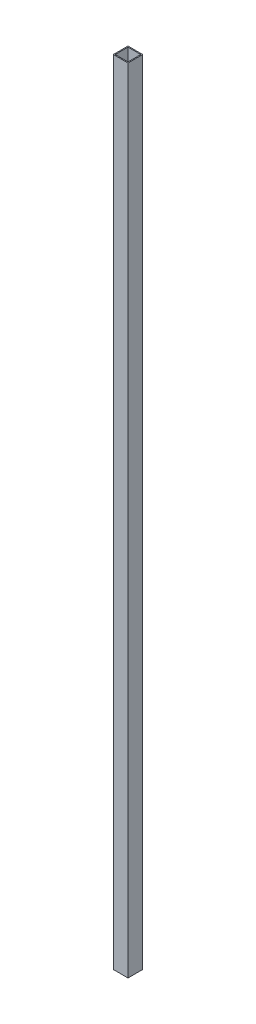
ISO-10303-21;
HEADER;
FILE_DESCRIPTION(('STEP AP214'),'2;1');
FILE_NAME('part.step','',(''),(''),'','','');
FILE_SCHEMA(('AUTOMOTIVE_DESIGN { 1 0 10303 214 1 1 1 1 }'));
ENDSEC;
DATA;
#1=APPLICATION_CONTEXT('core data for automotive mechanical design processes');
#2=APPLICATION_PROTOCOL_DEFINITION('international standard','automotive_design',2000,#1);
#3=PRODUCT_CONTEXT('',#1,'mechanical');
#4=PRODUCT('Part','Part','',(#3));
#5=PRODUCT_RELATED_PRODUCT_CATEGORY('part','',(#4));
#6=PRODUCT_DEFINITION_FORMATION('','',#4);
#7=PRODUCT_DEFINITION_CONTEXT('part definition',#1,'design');
#8=PRODUCT_DEFINITION('design','',#6,#7);
#9=PRODUCT_DEFINITION_SHAPE('','',#8);
#10=(LENGTH_UNIT() NAMED_UNIT(*) SI_UNIT(.MILLI.,.METRE.));
#11=(NAMED_UNIT(*) PLANE_ANGLE_UNIT() SI_UNIT($,.RADIAN.));
#12=(NAMED_UNIT(*) SI_UNIT($,.STERADIAN.) SOLID_ANGLE_UNIT());
#13=UNCERTAINTY_MEASURE_WITH_UNIT(LENGTH_MEASURE(1.E-05),#10,'distance_accuracy_value','');
#14=(GEOMETRIC_REPRESENTATION_CONTEXT(3) GLOBAL_UNCERTAINTY_ASSIGNED_CONTEXT((#13)) GLOBAL_UNIT_ASSIGNED_CONTEXT((#10,
#11,#12)) REPRESENTATION_CONTEXT('',''));
#15=CARTESIAN_POINT('',(0.,0.,0.));
#16=DIRECTION('',(0.,0.,1.));
#17=DIRECTION('',(1.,0.,0.));
#18=AXIS2_PLACEMENT_3D('',#15,#16,#17);
#19=CARTESIAN_POINT('',(0.,807.5,0.));
#20=DIRECTION('',(0.,1.,0.));
#21=DIRECTION('',(0.,0.,1.));
#22=AXIS2_PLACEMENT_3D('',#19,#20,#21);
#23=PLANE('',#22);
#24=DIRECTION('',(0.,0.,-1.));
#25=VECTOR('',#24,1.);
#26=CARTESIAN_POINT('',(15.,807.5,-15.));
#27=LINE('',#26,#25);
#28=CARTESIAN_POINT('',(15.,807.5,15.));
#29=VERTEX_POINT('',#28);
#30=CARTESIAN_POINT('',(15.,807.5,-15.));
#31=VERTEX_POINT('',#30);
#32=EDGE_CURVE('E137',#29,#31,#27,.T.);
#33=ORIENTED_EDGE('',*,*,#32,.T.);
#34=DIRECTION('',(-1.,0.,0.));
#35=VECTOR('',#34,1.);
#36=CARTESIAN_POINT('',(-15.,807.5,-15.));
#37=LINE('',#36,#35);
#38=CARTESIAN_POINT('',(-15.,807.5,-15.));
#39=VERTEX_POINT('',#38);
#40=EDGE_CURVE('E140',#31,#39,#37,.T.);
#41=ORIENTED_EDGE('',*,*,#40,.T.);
#42=DIRECTION('',(0.,0.,1.));
#43=VECTOR('',#42,1.);
#44=CARTESIAN_POINT('',(-15.,807.5,-15.));
#45=LINE('',#44,#43);
#46=CARTESIAN_POINT('',(-15.,807.5,15.));
#47=VERTEX_POINT('',#46);
#48=EDGE_CURVE('E143',#39,#47,#45,.T.);
#49=ORIENTED_EDGE('',*,*,#48,.T.);
#50=DIRECTION('',(1.,0.,0.));
#51=VECTOR('',#50,1.);
#52=CARTESIAN_POINT('',(-15.,807.5,15.));
#53=LINE('',#52,#51);
#54=EDGE_CURVE('E145',#47,#29,#53,.T.);
#55=ORIENTED_EDGE('',*,*,#54,.T.);
#56=EDGE_LOOP('',(#33,#41,#49,#55));
#57=FACE_BOUND('',#56,.T.);
#58=DIRECTION('',(0.,0.,1.));
#59=VECTOR('',#58,1.);
#60=CARTESIAN_POINT('',(-13.,807.5,-13.));
#61=LINE('',#60,#59);
#62=CARTESIAN_POINT('',(-13.,807.5,-13.));
#63=VERTEX_POINT('',#62);
#64=CARTESIAN_POINT('',(-13.,807.5,13.));
#65=VERTEX_POINT('',#64);
#66=EDGE_CURVE('E109',#63,#65,#61,.T.);
#67=ORIENTED_EDGE('',*,*,#66,.F.);
#68=DIRECTION('',(-1.,0.,0.));
#69=VECTOR('',#68,1.);
#70=CARTESIAN_POINT('',(-13.,807.5,-13.));
#71=LINE('',#70,#69);
#72=CARTESIAN_POINT('',(13.,807.5,-13.));
#73=VERTEX_POINT('',#72);
#74=EDGE_CURVE('E101',#73,#63,#71,.T.);
#75=ORIENTED_EDGE('',*,*,#74,.F.);
#76=DIRECTION('',(0.,0.,-1.));
#77=VECTOR('',#76,1.);
#78=CARTESIAN_POINT('',(13.,807.5,-13.));
#79=LINE('',#78,#77);
#80=CARTESIAN_POINT('',(13.,807.5,13.));
#81=VERTEX_POINT('',#80);
#82=EDGE_CURVE('E123',#81,#73,#79,.T.);
#83=ORIENTED_EDGE('',*,*,#82,.F.);
#84=DIRECTION('',(1.,0.,0.));
#85=VECTOR('',#84,1.);
#86=CARTESIAN_POINT('',(-13.,807.5,13.));
#87=LINE('',#86,#85);
#88=EDGE_CURVE('E121',#65,#81,#87,.T.);
#89=ORIENTED_EDGE('',*,*,#88,.F.);
#90=EDGE_LOOP('',(#67,#75,#83,#89));
#91=FACE_BOUND('',#90,.T.);
#92=ADVANCED_FACE('F36',(#57,#91),#23,.T.);
#93=CARTESIAN_POINT('',(0.,-807.5,0.));
#94=DIRECTION('',(0.,1.,0.));
#95=DIRECTION('',(0.,0.,1.));
#96=AXIS2_PLACEMENT_3D('',#93,#94,#95);
#97=PLANE('',#96);
#98=DIRECTION('',(0.,0.,-1.));
#99=VECTOR('',#98,1.);
#100=CARTESIAN_POINT('',(15.,-807.5,-15.));
#101=LINE('',#100,#99);
#102=CARTESIAN_POINT('',(15.,-807.5,15.));
#103=VERTEX_POINT('',#102);
#104=CARTESIAN_POINT('',(15.,-807.5,-15.));
#105=VERTEX_POINT('',#104);
#106=EDGE_CURVE('E117',#103,#105,#101,.T.);
#107=ORIENTED_EDGE('',*,*,#106,.F.);
#108=DIRECTION('',(1.,0.,0.));
#109=VECTOR('',#108,1.);
#110=CARTESIAN_POINT('',(-15.,-807.5,15.));
#111=LINE('',#110,#109);
#112=CARTESIAN_POINT('',(-15.,-807.5,15.));
#113=VERTEX_POINT('',#112);
#114=EDGE_CURVE('E141',#113,#103,#111,.T.);
#115=ORIENTED_EDGE('',*,*,#114,.F.);
#116=DIRECTION('',(0.,0.,1.));
#117=VECTOR('',#116,1.);
#118=CARTESIAN_POINT('',(-15.,-807.5,-15.));
#119=LINE('',#118,#117);
#120=CARTESIAN_POINT('',(-15.,-807.5,-15.));
#121=VERTEX_POINT('',#120);
#122=EDGE_CURVE('E152',#121,#113,#119,.T.);
#123=ORIENTED_EDGE('',*,*,#122,.F.);
#124=DIRECTION('',(-1.,0.,0.));
#125=VECTOR('',#124,1.);
#126=CARTESIAN_POINT('',(-15.,-807.5,-15.));
#127=LINE('',#126,#125);
#128=EDGE_CURVE('E150',#105,#121,#127,.T.);
#129=ORIENTED_EDGE('',*,*,#128,.F.);
#130=EDGE_LOOP('',(#107,#115,#123,#129));
#131=FACE_BOUND('',#130,.T.);
#132=DIRECTION('',(-1.,0.,0.));
#133=VECTOR('',#132,1.);
#134=CARTESIAN_POINT('',(-13.,-807.5,-13.));
#135=LINE('',#134,#133);
#136=CARTESIAN_POINT('',(13.,-807.5,-13.));
#137=VERTEX_POINT('',#136);
#138=CARTESIAN_POINT('',(-13.,-807.5,-13.));
#139=VERTEX_POINT('',#138);
#140=EDGE_CURVE('E59',#137,#139,#135,.T.);
#141=ORIENTED_EDGE('',*,*,#140,.T.);
#142=DIRECTION('',(0.,0.,1.));
#143=VECTOR('',#142,1.);
#144=CARTESIAN_POINT('',(-13.,-807.5,-13.));
#145=LINE('',#144,#143);
#146=CARTESIAN_POINT('',(-13.,-807.5,13.));
#147=VERTEX_POINT('',#146);
#148=EDGE_CURVE('E116',#139,#147,#145,.T.);
#149=ORIENTED_EDGE('',*,*,#148,.T.);
#150=DIRECTION('',(1.,0.,0.));
#151=VECTOR('',#150,1.);
#152=CARTESIAN_POINT('',(-13.,-807.5,13.));
#153=LINE('',#152,#151);
#154=CARTESIAN_POINT('',(13.,-807.5,13.));
#155=VERTEX_POINT('',#154);
#156=EDGE_CURVE('E129',#147,#155,#153,.T.);
#157=ORIENTED_EDGE('',*,*,#156,.T.);
#158=DIRECTION('',(0.,0.,-1.));
#159=VECTOR('',#158,1.);
#160=CARTESIAN_POINT('',(13.,-807.5,-13.));
#161=LINE('',#160,#159);
#162=EDGE_CURVE('E110',#155,#137,#161,.T.);
#163=ORIENTED_EDGE('',*,*,#162,.T.);
#164=EDGE_LOOP('',(#141,#149,#157,#163));
#165=FACE_BOUND('',#164,.T.);
#166=ADVANCED_FACE('F170',(#131,#165),#97,.F.);
#167=CARTESIAN_POINT('',(15.,807.5,-15.));
#168=DIRECTION('',(-1.,0.,0.));
#169=DIRECTION('',(0.,0.,1.));
#170=AXIS2_PLACEMENT_3D('',#167,#168,#169);
#171=PLANE('',#170);
#172=ORIENTED_EDGE('',*,*,#106,.T.);
#173=DIRECTION('',(0.,-1.,0.));
#174=VECTOR('',#173,1.);
#175=CARTESIAN_POINT('',(15.,807.5,-15.));
#176=LINE('',#175,#174);
#177=EDGE_CURVE('E11',#31,#105,#176,.T.);
#178=ORIENTED_EDGE('',*,*,#177,.F.);
#179=ORIENTED_EDGE('',*,*,#32,.F.);
#180=DIRECTION('',(0.,-1.,0.));
#181=VECTOR('',#180,1.);
#182=CARTESIAN_POINT('',(15.,807.5,15.));
#183=LINE('',#182,#181);
#184=EDGE_CURVE('E147',#29,#103,#183,.T.);
#185=ORIENTED_EDGE('',*,*,#184,.T.);
#186=EDGE_LOOP('',(#172,#178,#179,#185));
#187=FACE_BOUND('',#186,.T.);
#188=ADVANCED_FACE('F38',(#187),#171,.F.);
#189=CARTESIAN_POINT('',(-15.,807.5,-15.));
#190=DIRECTION('',(0.,0.,1.));
#191=DIRECTION('',(1.,0.,0.));
#192=AXIS2_PLACEMENT_3D('',#189,#190,#191);
#193=PLANE('',#192);
#194=ORIENTED_EDGE('',*,*,#128,.T.);
#195=DIRECTION('',(0.,-1.,0.));
#196=VECTOR('',#195,1.);
#197=CARTESIAN_POINT('',(-15.,807.5,-15.));
#198=LINE('',#197,#196);
#199=EDGE_CURVE('E44',#39,#121,#198,.T.);
#200=ORIENTED_EDGE('',*,*,#199,.F.);
#201=ORIENTED_EDGE('',*,*,#40,.F.);
#202=ORIENTED_EDGE('',*,*,#177,.T.);
#203=EDGE_LOOP('',(#194,#200,#201,#202));
#204=FACE_BOUND('',#203,.T.);
#205=ADVANCED_FACE('F180',(#204),#193,.F.);
#206=CARTESIAN_POINT('',(-15.,807.5,-15.));
#207=DIRECTION('',(1.,0.,0.));
#208=DIRECTION('',(0.,0.,-1.));
#209=AXIS2_PLACEMENT_3D('',#206,#207,#208);
#210=PLANE('',#209);
#211=ORIENTED_EDGE('',*,*,#122,.T.);
#212=DIRECTION('',(0.,-1.,0.));
#213=VECTOR('',#212,1.);
#214=CARTESIAN_POINT('',(-15.,807.5,15.));
#215=LINE('',#214,#213);
#216=EDGE_CURVE('E157',#47,#113,#215,.T.);
#217=ORIENTED_EDGE('',*,*,#216,.F.);
#218=ORIENTED_EDGE('',*,*,#48,.F.);
#219=ORIENTED_EDGE('',*,*,#199,.T.);
#220=EDGE_LOOP('',(#211,#217,#218,#219));
#221=FACE_BOUND('',#220,.T.);
#222=ADVANCED_FACE('F164',(#221),#210,.F.);
#223=CARTESIAN_POINT('',(-15.,807.5,15.));
#224=DIRECTION('',(0.,0.,-1.));
#225=DIRECTION('',(-1.,0.,0.));
#226=AXIS2_PLACEMENT_3D('',#223,#224,#225);
#227=PLANE('',#226);
#228=ORIENTED_EDGE('',*,*,#114,.T.);
#229=ORIENTED_EDGE('',*,*,#184,.F.);
#230=ORIENTED_EDGE('',*,*,#54,.F.);
#231=ORIENTED_EDGE('',*,*,#216,.T.);
#232=EDGE_LOOP('',(#228,#229,#230,#231));
#233=FACE_BOUND('',#232,.T.);
#234=ADVANCED_FACE('F174',(#233),#227,.F.);
#235=CARTESIAN_POINT('',(-13.,807.5,-13.));
#236=DIRECTION('',(0.,0.,1.));
#237=DIRECTION('',(1.,0.,0.));
#238=AXIS2_PLACEMENT_3D('',#235,#236,#237);
#239=PLANE('',#238);
#240=ORIENTED_EDGE('',*,*,#140,.F.);
#241=DIRECTION('',(0.,-1.,0.));
#242=VECTOR('',#241,1.);
#243=CARTESIAN_POINT('',(13.,807.5,-13.));
#244=LINE('',#243,#242);
#245=EDGE_CURVE('E105',#73,#137,#244,.T.);
#246=ORIENTED_EDGE('',*,*,#245,.F.);
#247=ORIENTED_EDGE('',*,*,#74,.T.);
#248=DIRECTION('',(0.,-1.,0.));
#249=VECTOR('',#248,1.);
#250=CARTESIAN_POINT('',(-13.,807.5,-13.));
#251=LINE('',#250,#249);
#252=EDGE_CURVE('E104',#63,#139,#251,.T.);
#253=ORIENTED_EDGE('',*,*,#252,.T.);
#254=EDGE_LOOP('',(#240,#246,#247,#253));
#255=FACE_BOUND('',#254,.T.);
#256=ADVANCED_FACE('F103',(#255),#239,.T.);
#257=CARTESIAN_POINT('',(-13.,807.5,-13.));
#258=DIRECTION('',(1.,0.,0.));
#259=DIRECTION('',(0.,0.,-1.));
#260=AXIS2_PLACEMENT_3D('',#257,#258,#259);
#261=PLANE('',#260);
#262=ORIENTED_EDGE('',*,*,#148,.F.);
#263=ORIENTED_EDGE('',*,*,#252,.F.);
#264=ORIENTED_EDGE('',*,*,#66,.T.);
#265=DIRECTION('',(0.,-1.,0.));
#266=VECTOR('',#265,1.);
#267=CARTESIAN_POINT('',(-13.,807.5,13.));
#268=LINE('',#267,#266);
#269=EDGE_CURVE('E118',#65,#147,#268,.T.);
#270=ORIENTED_EDGE('',*,*,#269,.T.);
#271=EDGE_LOOP('',(#262,#263,#264,#270));
#272=FACE_BOUND('',#271,.T.);
#273=ADVANCED_FACE('F113',(#272),#261,.T.);
#274=CARTESIAN_POINT('',(-13.,807.5,13.));
#275=DIRECTION('',(0.,0.,-1.));
#276=DIRECTION('',(-1.,0.,0.));
#277=AXIS2_PLACEMENT_3D('',#274,#275,#276);
#278=PLANE('',#277);
#279=ORIENTED_EDGE('',*,*,#156,.F.);
#280=ORIENTED_EDGE('',*,*,#269,.F.);
#281=ORIENTED_EDGE('',*,*,#88,.T.);
#282=DIRECTION('',(0.,-1.,0.));
#283=VECTOR('',#282,1.);
#284=CARTESIAN_POINT('',(13.,807.5,13.));
#285=LINE('',#284,#283);
#286=EDGE_CURVE('E51',#81,#155,#285,.T.);
#287=ORIENTED_EDGE('',*,*,#286,.T.);
#288=EDGE_LOOP('',(#279,#280,#281,#287));
#289=FACE_BOUND('',#288,.T.);
#290=ADVANCED_FACE('F203',(#289),#278,.T.);
#291=CARTESIAN_POINT('',(13.,807.5,-13.));
#292=DIRECTION('',(-1.,0.,0.));
#293=DIRECTION('',(0.,0.,1.));
#294=AXIS2_PLACEMENT_3D('',#291,#292,#293);
#295=PLANE('',#294);
#296=ORIENTED_EDGE('',*,*,#162,.F.);
#297=ORIENTED_EDGE('',*,*,#286,.F.);
#298=ORIENTED_EDGE('',*,*,#82,.T.);
#299=ORIENTED_EDGE('',*,*,#245,.T.);
#300=EDGE_LOOP('',(#296,#297,#298,#299));
#301=FACE_BOUND('',#300,.T.);
#302=ADVANCED_FACE('F207',(#301),#295,.T.);
#303=CLOSED_SHELL('',(#92,#166,#188,#205,#222,#234,#256,#273,#290,#302));
#304=MANIFOLD_SOLID_BREP('B2',#303);
#305=ADVANCED_BREP_SHAPE_REPRESENTATION('',(#18,#304),#14);
#306=SHAPE_DEFINITION_REPRESENTATION(#9,#305);
ENDSEC;
END-ISO-10303-21;
